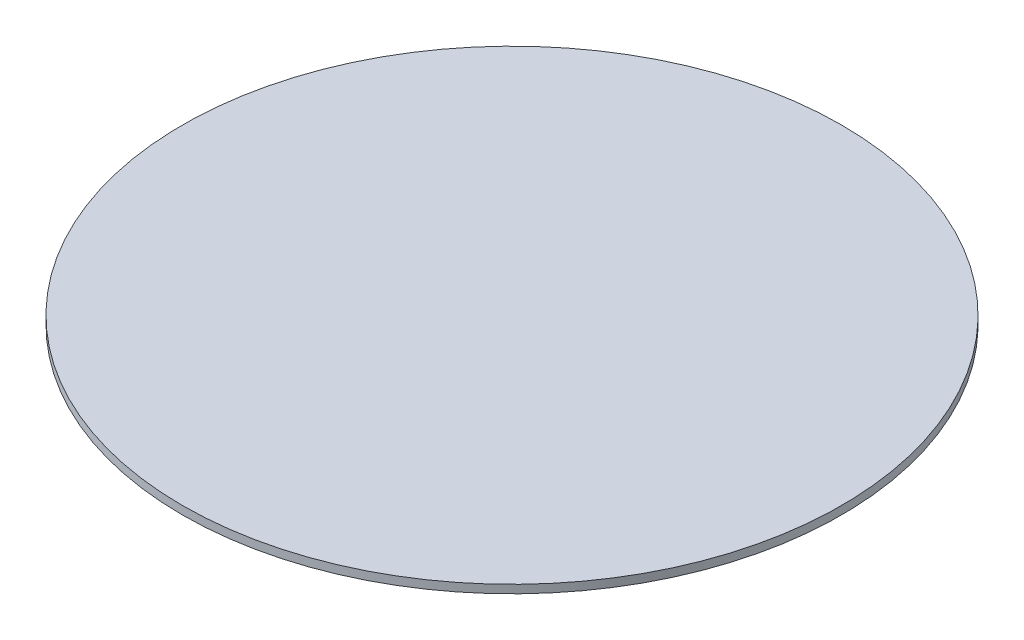
ISO-10303-21;
HEADER;
FILE_DESCRIPTION(('STEP AP214'),'2;1');
FILE_NAME('part.step','',(''),(''),'','','');
FILE_SCHEMA(('AUTOMOTIVE_DESIGN { 1 0 10303 214 1 1 1 1 }'));
ENDSEC;
DATA;
#1=APPLICATION_CONTEXT('core data for automotive mechanical design processes');
#2=APPLICATION_PROTOCOL_DEFINITION('international standard','automotive_design',2000,#1);
#3=PRODUCT_CONTEXT('',#1,'mechanical');
#4=PRODUCT('Part','Part','',(#3));
#5=PRODUCT_RELATED_PRODUCT_CATEGORY('part','',(#4));
#6=PRODUCT_DEFINITION_FORMATION('','',#4);
#7=PRODUCT_DEFINITION_CONTEXT('part definition',#1,'design');
#8=PRODUCT_DEFINITION('design','',#6,#7);
#9=PRODUCT_DEFINITION_SHAPE('','',#8);
#10=(LENGTH_UNIT() NAMED_UNIT(*) SI_UNIT(.MILLI.,.METRE.));
#11=(NAMED_UNIT(*) PLANE_ANGLE_UNIT() SI_UNIT($,.RADIAN.));
#12=(NAMED_UNIT(*) SI_UNIT($,.STERADIAN.) SOLID_ANGLE_UNIT());
#13=UNCERTAINTY_MEASURE_WITH_UNIT(LENGTH_MEASURE(1.E-05),#10,'distance_accuracy_value','');
#14=(GEOMETRIC_REPRESENTATION_CONTEXT(3) GLOBAL_UNCERTAINTY_ASSIGNED_CONTEXT((#13)) GLOBAL_UNIT_ASSIGNED_CONTEXT((#10,
#11,#12)) REPRESENTATION_CONTEXT('',''));
#15=CARTESIAN_POINT('',(0.,0.,0.));
#16=DIRECTION('',(0.,0.,1.));
#17=DIRECTION('',(1.,0.,0.));
#18=AXIS2_PLACEMENT_3D('',#15,#16,#17);
#19=CARTESIAN_POINT('',(0.,1.5,0.));
#20=DIRECTION('',(0.,-1.,0.));
#21=DIRECTION('',(0.,0.,-1.));
#22=AXIS2_PLACEMENT_3D('',#19,#20,#21);
#23=CYLINDRICAL_SURFACE('',#22,60.);
#24=CARTESIAN_POINT('',(0.,1.5,0.));
#25=DIRECTION('',(0.,1.,0.));
#26=DIRECTION('',(0.,0.,1.));
#27=AXIS2_PLACEMENT_3D('',#24,#25,#26);
#28=CIRCLE('',#27,60.);
#29=CARTESIAN_POINT('',(0.,1.5,60.));
#30=VERTEX_POINT('',#29);
#31=EDGE_CURVE('E10',#30,#30,#28,.T.);
#32=ORIENTED_EDGE('',*,*,#31,.F.);
#33=EDGE_LOOP('',(#32));
#34=FACE_BOUND('',#33,.T.);
#35=CARTESIAN_POINT('',(0.,0.,0.));
#36=DIRECTION('',(0.,1.,0.));
#37=DIRECTION('',(0.,0.,1.));
#38=AXIS2_PLACEMENT_3D('',#35,#36,#37);
#39=CIRCLE('',#38,60.);
#40=CARTESIAN_POINT('',(0.,0.,60.));
#41=VERTEX_POINT('',#40);
#42=EDGE_CURVE('E40',#41,#41,#39,.T.);
#43=ORIENTED_EDGE('',*,*,#42,.T.);
#44=EDGE_LOOP('',(#43));
#45=FACE_BOUND('',#44,.T.);
#46=ADVANCED_FACE('F37',(#34,#45),#23,.T.);
#47=CARTESIAN_POINT('',(0.,1.5,0.));
#48=DIRECTION('',(0.,1.,0.));
#49=DIRECTION('',(0.,0.,1.));
#50=AXIS2_PLACEMENT_3D('',#47,#48,#49);
#51=PLANE('',#50);
#52=ORIENTED_EDGE('',*,*,#31,.T.);
#53=EDGE_LOOP('',(#52));
#54=FACE_BOUND('',#53,.T.);
#55=ADVANCED_FACE('F52',(#54),#51,.T.);
#56=CARTESIAN_POINT('',(0.,0.,0.));
#57=DIRECTION('',(0.,1.,0.));
#58=DIRECTION('',(0.,0.,1.));
#59=AXIS2_PLACEMENT_3D('',#56,#57,#58);
#60=PLANE('',#59);
#61=ORIENTED_EDGE('',*,*,#42,.F.);
#62=EDGE_LOOP('',(#61));
#63=FACE_BOUND('',#62,.T.);
#64=ADVANCED_FACE('F50',(#63),#60,.F.);
#65=CLOSED_SHELL('',(#46,#55,#64));
#66=MANIFOLD_SOLID_BREP('B2',#65);
#67=ADVANCED_BREP_SHAPE_REPRESENTATION('',(#18,#66),#14);
#68=SHAPE_DEFINITION_REPRESENTATION(#9,#67);
ENDSEC;
END-ISO-10303-21;
